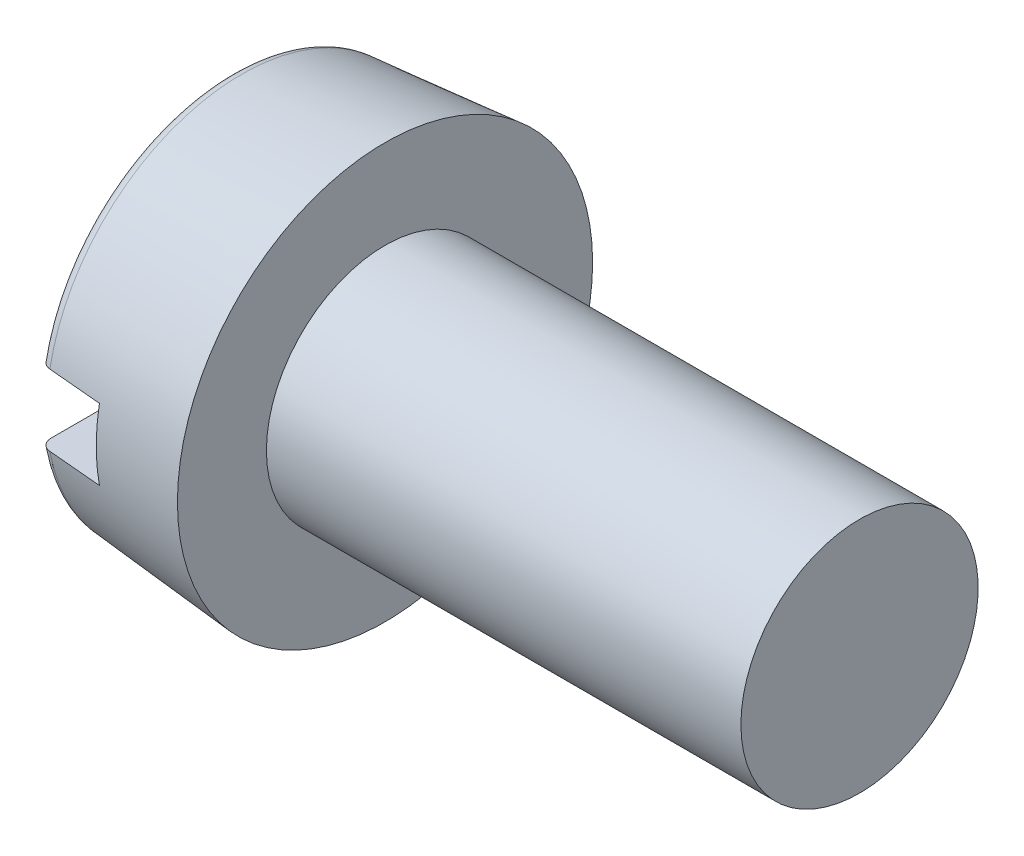
ISO-10303-21;
HEADER;
FILE_DESCRIPTION(('STEP AP214'),'2;1');
FILE_NAME('part.step','',(''),(''),'','','');
FILE_SCHEMA(('AUTOMOTIVE_DESIGN { 1 0 10303 214 1 1 1 1 }'));
ENDSEC;
DATA;
#1=APPLICATION_CONTEXT('core data for automotive mechanical design processes');
#2=APPLICATION_PROTOCOL_DEFINITION('international standard','automotive_design',2000,#1);
#3=PRODUCT_CONTEXT('',#1,'mechanical');
#4=PRODUCT('Part','Part','',(#3));
#5=PRODUCT_RELATED_PRODUCT_CATEGORY('part','',(#4));
#6=PRODUCT_DEFINITION_FORMATION('','',#4);
#7=PRODUCT_DEFINITION_CONTEXT('part definition',#1,'design');
#8=PRODUCT_DEFINITION('design','',#6,#7);
#9=PRODUCT_DEFINITION_SHAPE('','',#8);
#10=(LENGTH_UNIT() NAMED_UNIT(*) SI_UNIT(.MILLI.,.METRE.));
#11=(NAMED_UNIT(*) PLANE_ANGLE_UNIT() SI_UNIT($,.RADIAN.));
#12=(NAMED_UNIT(*) SI_UNIT($,.STERADIAN.) SOLID_ANGLE_UNIT());
#13=UNCERTAINTY_MEASURE_WITH_UNIT(LENGTH_MEASURE(1.E-05),#10,'distance_accuracy_value','');
#14=(GEOMETRIC_REPRESENTATION_CONTEXT(3) GLOBAL_UNCERTAINTY_ASSIGNED_CONTEXT((#13)) GLOBAL_UNIT_ASSIGNED_CONTEXT((#10,
#11,#12)) REPRESENTATION_CONTEXT('',''));
#15=CARTESIAN_POINT('',(0.,0.,0.));
#16=DIRECTION('',(0.,0.,1.));
#17=DIRECTION('',(1.,0.,0.));
#18=AXIS2_PLACEMENT_3D('',#15,#16,#17);
#19=CARTESIAN_POINT('',(1.1,0.6,-3.5));
#20=DIRECTION('',(-1.,0.,0.));
#21=DIRECTION('',(0.,0.,1.));
#22=AXIS2_PLACEMENT_3D('',#19,#20,#21);
#23=PLANE('',#22);
#24=DIRECTION('',(0.,0.,1.));
#25=VECTOR('',#24,1.);
#26=CARTESIAN_POINT('',(1.1,0.6,3.5));
#27=LINE('',#26,#25);
#28=CARTESIAN_POINT('',(1.10000000000466,0.6,3.31490439259874));
#29=VERTEX_POINT('',#28);
#30=CARTESIAN_POINT('',(1.10000000000405,0.6,-3.31490439259869));
#31=VERTEX_POINT('',#30);
#32=EDGE_CURVE('E78',#29,#31,#27,.F.);
#33=ORIENTED_EDGE('',*,*,#32,.T.);
#34=CARTESIAN_POINT('',(1.10000000000809,0.,0.));
#35=DIRECTION('',(1.,0.,0.));
#36=DIRECTION('',(0.,0.,-1.));
#37=AXIS2_PLACEMENT_3D('',#34,#35,#36);
#38=CIRCLE('',#37,3.36876700471737);
#39=CARTESIAN_POINT('',(1.10000000000468,-0.6,-3.31490439259874));
#40=VERTEX_POINT('',#39);
#41=EDGE_CURVE('E87',#31,#40,#38,.F.);
#42=ORIENTED_EDGE('',*,*,#41,.T.);
#43=DIRECTION('',(0.,0.,-1.));
#44=VECTOR('',#43,1.);
#45=CARTESIAN_POINT('',(1.1,-0.6,-3.5));
#46=LINE('',#45,#44);
#47=CARTESIAN_POINT('',(1.10000000000405,-0.6,3.31490439259869));
#48=VERTEX_POINT('',#47);
#49=EDGE_CURVE('E85',#40,#48,#46,.F.);
#50=ORIENTED_EDGE('',*,*,#49,.T.);
#51=CARTESIAN_POINT('',(1.10000000000809,0.,0.));
#52=DIRECTION('',(1.,0.,0.));
#53=DIRECTION('',(0.,0.,-1.));
#54=AXIS2_PLACEMENT_3D('',#51,#52,#53);
#55=CIRCLE('',#54,3.36876700471737);
#56=EDGE_CURVE('E20',#48,#29,#55,.F.);
#57=ORIENTED_EDGE('',*,*,#56,.T.);
#58=EDGE_LOOP('',(#33,#42,#50,#57));
#59=FACE_BOUND('',#58,.T.);
#60=ADVANCED_FACE('F17',(#59),#23,.T.);
#61=CARTESIAN_POINT('',(1.1,0.6,3.5));
#62=DIRECTION('',(0.,1.,0.));
#63=DIRECTION('',(0.,0.,1.));
#64=AXIS2_PLACEMENT_3D('',#61,#62,#63);
#65=PLANE('',#64);
#66=ORIENTED_EDGE('',*,*,#32,.F.);
#67=CARTESIAN_POINT('',(0.182568851454256,0.6,3.2333027364581));
#68=CARTESIAN_POINT('',(0.335473556850061,0.6,3.24690847681179));
#69=CARTESIAN_POINT('',(0.488378505260504,0.6,3.26051148500036));
#70=CARTESIAN_POINT('',(0.794188888109492,0.6,3.28771203704714));
#71=CARTESIAN_POINT('',(0.947094322548035,0.6,3.30130958090535));
#72=CARTESIAN_POINT('',(1.10000000000122,0.6,3.31490439259843));
#73=B_SPLINE_CURVE_WITH_KNOTS('',3,(#67,#68,#69,#70,#71,#72),.UNSPECIFIED.,.F.,.F.,(4,2,4),(0.,
0.460526530963861,0.921053061924176),.UNSPECIFIED.);
#74=CARTESIAN_POINT('',(0.182568851463089,0.6,3.23330273645694));
#75=VERTEX_POINT('',#74);
#76=EDGE_CURVE('E69',#75,#29,#73,.T.);
#77=ORIENTED_EDGE('',*,*,#76,.F.);
#78=CARTESIAN_POINT('',(0.,0.6,3.03043682761993));
#79=CARTESIAN_POINT('',(-8.92276711974184E-06,0.600000000000927,3.04205210805298));
#80=CARTESIAN_POINT('',(0.000973204864241729,0.600000000000543,3.05366618875901));
#81=CARTESIAN_POINT('',(0.00485838237463909,0.599999999999457,3.07656708233098));
#82=CARTESIAN_POINT('',(0.0077611800515547,0.599999999998755,3.08785393796157));
#83=CARTESIAN_POINT('',(0.0154293297762815,0.599999999999336,3.10978668687681));
#84=CARTESIAN_POINT('',(0.0201960317635939,0.60000000000062,3.12043210913728));
#85=CARTESIAN_POINT('',(0.0314639130665987,0.59999999999938,3.14075672068877));
#86=CARTESIAN_POINT('',(0.0379643576695792,0.599999999996857,3.15043631688841));
#87=CARTESIAN_POINT('',(0.0524560587306094,0.599999999997461,3.16845455019423));
#88=CARTESIAN_POINT('',(0.0604324501561302,0.600000000000534,3.17680513564901));
#89=CARTESIAN_POINT('',(0.077695534249092,0.599999999999466,3.19201902933438));
#90=CARTESIAN_POINT('',(0.0869820289644168,0.599999999995325,3.19888256185703));
#91=CARTESIAN_POINT('',(0.106435856679454,0.599999999995523,3.21080710889614));
#92=CARTESIAN_POINT('',(0.116586055155841,0.599999999999724,3.2158960924536));
#93=CARTESIAN_POINT('',(0.137592975718862,0.600000000000276,3.22425888492082));
#94=CARTESIAN_POINT('',(0.148448535761882,0.59999999999664,3.22753559876399));
#95=CARTESIAN_POINT('',(0.167114441065982,0.599999999995136,3.23146563373131));
#96=CARTESIAN_POINT('',(0.174822526263817,0.599999999995827,3.23261780195108));
#97=CARTESIAN_POINT('',(0.18256885145479,0.6,3.23330273645209));
#98=B_SPLINE_CURVE_WITH_KNOTS('',3,(#78,#79,#80,#81,#82,#83,#84,#85,#86,#87,#88,#89,#90,#91,#92,
#93,#94,#95,#96,#97),.UNSPECIFIED.,.F.,.F.,(4,2,2,2,2,2,2,2,2,4),(0.,0.0348029281865732,
0.0696012873266002,0.104424896125296,0.139233771014051,0.173709468497491,0.208179962389297,
0.24207959089462,0.275924722159497,0.299249852575362),.UNSPECIFIED.);
#99=CARTESIAN_POINT('',(0.,0.6,3.03043682761993));
#100=VERTEX_POINT('',#99);
#101=EDGE_CURVE('E79',#100,#75,#98,.T.);
#102=ORIENTED_EDGE('',*,*,#101,.F.);
#103=DIRECTION('',(0.,0.,1.));
#104=VECTOR('',#103,1.);
#105=CARTESIAN_POINT('',(0.,0.6,0.));
#106=LINE('',#105,#104);
#107=CARTESIAN_POINT('',(0.,0.6,-3.03043682761993));
#108=VERTEX_POINT('',#107);
#109=EDGE_CURVE('E110',#108,#100,#106,.T.);
#110=ORIENTED_EDGE('',*,*,#109,.F.);
#111=CARTESIAN_POINT('',(0.182568851454788,0.6,-3.23330273645209));
#112=CARTESIAN_POINT('',(0.171472681594623,0.600000000000002,-3.23232565957753));
#113=CARTESIAN_POINT('',(0.160466490440903,0.600000000000001,-3.23038681875744));
#114=CARTESIAN_POINT('',(0.138948426592135,0.599999999999999,-3.22469378570043));
#115=CARTESIAN_POINT('',(0.128435940886201,0.599999999999998,-3.22094191371361));
#116=CARTESIAN_POINT('',(0.108187049490752,0.600000000000002,-3.21172671697903));
#117=CARTESIAN_POINT('',(0.0984508547008828,0.600000000000008,-3.20626292911875));
#118=CARTESIAN_POINT('',(0.080024520000221,0.599999999999992,-3.19379308445501));
#119=CARTESIAN_POINT('',(0.0713343007624213,0.599999999999969,-3.1867871447228));
#120=CARTESIAN_POINT('',(0.0551599248927893,0.600000000000031,-3.17137098416005));
#121=CARTESIAN_POINT('',(0.0476868506805737,0.600000000000118,-3.1629491407325));
#122=CARTESIAN_POINT('',(0.0342322998309476,0.599999999999882,-3.14498762109246));
#123=CARTESIAN_POINT('',(0.0282510437499761,0.599999999999561,-3.13544777989675));
#124=CARTESIAN_POINT('',(0.0178400343955592,0.599999999999599,-3.11534500552784));
#125=CARTESIAN_POINT('',(0.0134390539697862,0.599999999999972,-3.10476717226775));
#126=CARTESIAN_POINT('',(0.00645122030947714,0.600000000000028,-3.08304101716856));
#127=CARTESIAN_POINT('',(0.00386248123053304,0.599999999999714,-3.07189330136284));
#128=CARTESIAN_POINT('',(0.000734376375379277,0.599999999999458,-3.05062255742231));
#129=CARTESIAN_POINT('',(-6.07384206097023E-06,0.599999999999478,-3.04052874119681));
#130=CARTESIAN_POINT('',(0.,0.6,-3.03043682761993));
#131=B_SPLINE_CURVE_WITH_KNOTS('',3,(#111,#112,#113,#114,#115,#116,#117,#118,#119,#120,#121,
#122,#123,#124,#125,#126,#127,#128,#129,#130),.UNSPECIFIED.,.F.,.F.,(4,2,2,2,2,2,2,2,2,4),(0.,
0.0333698869919508,0.0666971810854076,0.100033498772122,0.133367286630275,0.166989405711504,
0.200616492680494,0.234828037616769,0.269003928393339,0.299257989197879),.UNSPECIFIED.);
#132=CARTESIAN_POINT('',(0.182568851462821,0.6,-3.23330273645994));
#133=VERTEX_POINT('',#132);
#134=EDGE_CURVE('E158',#133,#108,#131,.T.);
#135=ORIENTED_EDGE('',*,*,#134,.F.);
#136=CARTESIAN_POINT('',(1.10000000000126,0.6,-3.31490439259843));
#137=CARTESIAN_POINT('',(0.947094322548068,0.6,-3.30130958090535));
#138=CARTESIAN_POINT('',(0.794188888109517,0.6,-3.28771203704714));
#139=CARTESIAN_POINT('',(0.488378505260516,0.6,-3.26051148500036));
#140=CARTESIAN_POINT('',(0.335473556850066,0.6,-3.24690847681179));
#141=CARTESIAN_POINT('',(0.182568851454254,0.6,-3.2333027364581));
#142=B_SPLINE_CURVE_WITH_KNOTS('',3,(#136,#137,#138,#139,#140,#141),.UNSPECIFIED.,.F.,.F.,(4,2,
4),(0.,0.460526530960336,0.921053061924218),.UNSPECIFIED.);
#143=EDGE_CURVE('E90',#31,#133,#142,.T.);
#144=ORIENTED_EDGE('',*,*,#143,.F.);
#145=EDGE_LOOP('',(#66,#77,#102,#110,#135,#144));
#146=FACE_BOUND('',#145,.T.);
#147=ADVANCED_FACE('F88',(#146),#65,.F.);
#148=CARTESIAN_POINT('',(1.1,-0.6,-3.5));
#149=DIRECTION('',(0.,-1.,0.));
#150=DIRECTION('',(0.,0.,-1.));
#151=AXIS2_PLACEMENT_3D('',#148,#149,#150);
#152=PLANE('',#151);
#153=CARTESIAN_POINT('',(0.,-0.6,-3.03043682761993));
#154=CARTESIAN_POINT('',(-8.92276711967487E-06,-0.600000000000927,-3.04205210805298));
#155=CARTESIAN_POINT('',(0.000973204864241762,-0.600000000000543,-3.05366618875901));
#156=CARTESIAN_POINT('',(0.00485838237463903,-0.599999999999457,-3.07656708233098));
#157=CARTESIAN_POINT('',(0.00776118005155457,-0.599999999998755,-3.08785393796157));
#158=CARTESIAN_POINT('',(0.0154293297762813,-0.599999999999336,-3.10978668687681));
#159=CARTESIAN_POINT('',(0.0201960317635939,-0.60000000000062,-3.12043210913728));
#160=CARTESIAN_POINT('',(0.0314639130665989,-0.59999999999938,-3.14075672068877));
#161=CARTESIAN_POINT('',(0.0379643576695795,-0.599999999996856,-3.15043631688841));
#162=CARTESIAN_POINT('',(0.0524560587306098,-0.599999999997461,-3.16845455019423));
#163=CARTESIAN_POINT('',(0.0604324501561305,-0.600000000000534,-3.17680513564901));
#164=CARTESIAN_POINT('',(0.0776955342490921,-0.599999999999466,-3.19201902933438));
#165=CARTESIAN_POINT('',(0.0869820289644169,-0.599999999995324,-3.19888256185703));
#166=CARTESIAN_POINT('',(0.106435856679454,-0.599999999995523,-3.21080710889614));
#167=CARTESIAN_POINT('',(0.116586055155841,-0.599999999999724,-3.2158960924536));
#168=CARTESIAN_POINT('',(0.137592975718862,-0.600000000000276,-3.22425888492082));
#169=CARTESIAN_POINT('',(0.148448535761883,-0.599999999996639,-3.22753559876399));
#170=CARTESIAN_POINT('',(0.167114441066279,-0.599999999995135,-3.23146563373137));
#171=CARTESIAN_POINT('',(0.174822526264417,-0.599999999995826,-3.23261780195117));
#172=CARTESIAN_POINT('',(0.182568851455695,-0.6,-3.23330273645218));
#173=B_SPLINE_CURVE_WITH_KNOTS('',3,(#153,#154,#155,#156,#157,#158,#159,#160,#161,#162,#163,
#164,#165,#166,#167,#168,#169,#170,#171,#172),.UNSPECIFIED.,.F.,.F.,(4,2,2,2,2,2,2,2,2,4),(0.,
0.0348029281865732,0.0696012873266001,0.104424896125296,0.139233771014051,0.173709468497491,
0.208179962389297,0.242079590894619,0.275924722159498,0.299249852576269),.UNSPECIFIED.);
#174=CARTESIAN_POINT('',(0.,-0.6,-3.03043682761993));
#175=VERTEX_POINT('',#174);
#176=CARTESIAN_POINT('',(0.182568851463542,-0.6,-3.23330273645698));
#177=VERTEX_POINT('',#176);
#178=EDGE_CURVE('E111',#175,#177,#173,.T.);
#179=ORIENTED_EDGE('',*,*,#178,.F.);
#180=DIRECTION('',(0.,0.,1.));
#181=VECTOR('',#180,1.);
#182=CARTESIAN_POINT('',(0.,-0.6,0.));
#183=LINE('',#182,#181);
#184=CARTESIAN_POINT('',(0.,-0.6,3.03043682761993));
#185=VERTEX_POINT('',#184);
#186=EDGE_CURVE('E181',#185,#175,#183,.F.);
#187=ORIENTED_EDGE('',*,*,#186,.F.);
#188=CARTESIAN_POINT('',(0.18256885145479,-0.6,3.23330273645209));
#189=CARTESIAN_POINT('',(0.171472681594624,-0.600000000000004,3.23232565957753));
#190=CARTESIAN_POINT('',(0.160466490440904,-0.600000000000002,3.23038681875744));
#191=CARTESIAN_POINT('',(0.138948426592136,-0.599999999999999,3.22469378570043));
#192=CARTESIAN_POINT('',(0.128435940886202,-0.599999999999997,3.22094191371361));
#193=CARTESIAN_POINT('',(0.108187049490754,-0.600000000000002,3.21172671697903));
#194=CARTESIAN_POINT('',(0.0984508547008837,-0.600000000000009,3.20626292911876));
#195=CARTESIAN_POINT('',(0.0800245200002219,-0.599999999999992,3.19379308445501));
#196=CARTESIAN_POINT('',(0.0713343007624226,-0.599999999999969,3.1867871447228));
#197=CARTESIAN_POINT('',(0.0551599248927912,-0.600000000000031,3.17137098416005));
#198=CARTESIAN_POINT('',(0.0476868506805758,-0.600000000000118,3.1629491407325));
#199=CARTESIAN_POINT('',(0.0342322998309492,-0.599999999999884,3.14498762109247));
#200=CARTESIAN_POINT('',(0.028251043749977,-0.599999999999562,3.13544777989675));
#201=CARTESIAN_POINT('',(0.0178400343955596,-0.5999999999996,3.11534500552784));
#202=CARTESIAN_POINT('',(0.0134390539697872,-0.599999999999972,3.10476717226775));
#203=CARTESIAN_POINT('',(0.0064512203094781,-0.600000000000029,3.08304101716857));
#204=CARTESIAN_POINT('',(0.00386248123053366,-0.599999999999715,3.07189330136284));
#205=CARTESIAN_POINT('',(0.000734376375379537,-0.599999999999459,3.05062255742231));
#206=CARTESIAN_POINT('',(-6.07384206089883E-06,-0.599999999999478,3.04052874119681));
#207=CARTESIAN_POINT('',(0.,-0.6,3.03043682761993));
#208=B_SPLINE_CURVE_WITH_KNOTS('',3,(#188,#189,#190,#191,#192,#193,#194,#195,#196,#197,#198,
#199,#200,#201,#202,#203,#204,#205,#206,#207),.UNSPECIFIED.,.F.,.F.,(4,2,2,2,2,2,2,2,2,4),(0.,
0.0333698869919515,0.0666971810854082,0.100033498772123,0.133367286630275,0.166989405711503,
0.200616492680491,0.234828037616767,0.269003928393341,0.299257989197881),.UNSPECIFIED.);
#209=CARTESIAN_POINT('',(0.182568851462822,-0.6,3.23330273645994));
#210=VERTEX_POINT('',#209);
#211=EDGE_CURVE('E35',#210,#185,#208,.T.);
#212=ORIENTED_EDGE('',*,*,#211,.F.);
#213=CARTESIAN_POINT('',(1.10000000000122,-0.6,3.31490439259843));
#214=CARTESIAN_POINT('',(0.947094322548035,-0.600000000000001,3.30130958090535));
#215=CARTESIAN_POINT('',(0.794188888109492,-0.600000000000001,3.28771203704714));
#216=CARTESIAN_POINT('',(0.488378505260504,-0.600000000000001,3.26051148500036));
#217=CARTESIAN_POINT('',(0.335473556850061,-0.600000000000001,3.24690847681179));
#218=CARTESIAN_POINT('',(0.182568851454256,-0.6,3.2333027364581));
#219=B_SPLINE_CURVE_WITH_KNOTS('',3,(#213,#214,#215,#216,#217,#218),.UNSPECIFIED.,.F.,.F.,(4,2,
4),(0.,0.460526530960315,0.921053061924176),.UNSPECIFIED.);
#220=EDGE_CURVE('E129',#48,#210,#219,.T.);
#221=ORIENTED_EDGE('',*,*,#220,.F.);
#222=ORIENTED_EDGE('',*,*,#49,.F.);
#223=CARTESIAN_POINT('',(0.182568851455161,-0.6,-3.23330273645818));
#224=CARTESIAN_POINT('',(0.335473556850822,-0.6,-3.24690847681186));
#225=CARTESIAN_POINT('',(0.488378505261121,-0.6,-3.26051148500042));
#226=CARTESIAN_POINT('',(0.79418888810982,-0.6,-3.28771203704717));
#227=CARTESIAN_POINT('',(0.94709432254822,-0.6,-3.30130958090537));
#228=CARTESIAN_POINT('',(1.10000000000126,-0.6,-3.31490439259843));
#229=B_SPLINE_CURVE_WITH_KNOTS('',3,(#223,#224,#225,#226,#227,#228),.UNSPECIFIED.,.F.,.F.,(4,2,
4),(0.,0.460526530963426,0.921053061923307),.UNSPECIFIED.);
#230=EDGE_CURVE('E102',#177,#40,#229,.T.);
#231=ORIENTED_EDGE('',*,*,#230,.F.);
#232=EDGE_LOOP('',(#179,#187,#212,#221,#222,#231));
#233=FACE_BOUND('',#232,.T.);
#234=ADVANCED_FACE('F113',(#233),#152,.F.);
#235=CARTESIAN_POINT('',(0.,0.,0.));
#236=DIRECTION('',(-1.,0.,0.));
#237=DIRECTION('',(0.,0.,1.));
#238=AXIS2_PLACEMENT_3D('',#235,#236,#237);
#239=PLANE('',#238);
#240=ORIENTED_EDGE('',*,*,#109,.T.);
#241=CARTESIAN_POINT('',(0.,0.,0.));
#242=DIRECTION('',(1.,0.,0.));
#243=DIRECTION('',(0.,0.194221066118774,-0.980957785776578));
#244=AXIS2_PLACEMENT_3D('',#241,#242,#243);
#245=CIRCLE('',#244,3.08926324002912);
#246=EDGE_CURVE('E188',#108,#100,#245,.T.);
#247=ORIENTED_EDGE('',*,*,#246,.F.);
#248=EDGE_LOOP('',(#240,#247));
#249=FACE_BOUND('',#248,.T.);
#250=ADVANCED_FACE('F209',(#249),#239,.T.);
#251=CARTESIAN_POINT('',(0.,0.,0.));
#252=DIRECTION('',(-1.,0.,0.));
#253=DIRECTION('',(0.,0.,1.));
#254=AXIS2_PLACEMENT_3D('',#251,#252,#253);
#255=PLANE('',#254);
#256=ORIENTED_EDGE('',*,*,#186,.T.);
#257=CARTESIAN_POINT('',(0.,0.,0.));
#258=DIRECTION('',(1.,0.,0.));
#259=DIRECTION('',(0.,-0.194221066118772,0.980957785776578));
#260=AXIS2_PLACEMENT_3D('',#257,#258,#259);
#261=CIRCLE('',#260,3.08926324002912);
#262=EDGE_CURVE('E173',#185,#175,#261,.T.);
#263=ORIENTED_EDGE('',*,*,#262,.F.);
#264=EDGE_LOOP('',(#256,#263));
#265=FACE_BOUND('',#264,.T.);
#266=ADVANCED_FACE('F164',(#265),#255,.T.);
#267=CARTESIAN_POINT('',(0.2,0.,0.));
#268=DIRECTION('',(-1.,0.,0.));
#269=DIRECTION('',(0.,0.,1.));
#270=AXIS2_PLACEMENT_3D('',#267,#268,#269);
#271=TOROIDAL_SURFACE('',#270,3.08926324002912,0.2);
#272=ORIENTED_EDGE('',*,*,#101,.T.);
#273=CARTESIAN_POINT('',(0.182568851471388,0.,0.));
#274=DIRECTION('',(1.,0.,0.));
#275=DIRECTION('',(0.,0.,-1.));
#276=AXIS2_PLACEMENT_3D('',#273,#274,#275);
#277=CIRCLE('',#276,3.28850217965737);
#278=EDGE_CURVE('E75',#133,#75,#277,.T.);
#279=ORIENTED_EDGE('',*,*,#278,.F.);
#280=ORIENTED_EDGE('',*,*,#134,.T.);
#281=ORIENTED_EDGE('',*,*,#246,.T.);
#282=EDGE_LOOP('',(#272,#279,#280,#281));
#283=FACE_BOUND('',#282,.T.);
#284=ADVANCED_FACE('F159',(#283),#271,.T.);
#285=CARTESIAN_POINT('',(0.2,0.,0.));
#286=DIRECTION('',(-1.,0.,0.));
#287=DIRECTION('',(0.,0.,1.));
#288=AXIS2_PLACEMENT_3D('',#285,#286,#287);
#289=TOROIDAL_SURFACE('',#288,3.08926324002912,0.2);
#290=ORIENTED_EDGE('',*,*,#211,.T.);
#291=ORIENTED_EDGE('',*,*,#262,.T.);
#292=ORIENTED_EDGE('',*,*,#178,.T.);
#293=CARTESIAN_POINT('',(0.182568851471388,0.,0.));
#294=DIRECTION('',(1.,0.,0.));
#295=DIRECTION('',(0.,0.,-1.));
#296=AXIS2_PLACEMENT_3D('',#293,#294,#295);
#297=CIRCLE('',#296,3.28850217965737);
#298=EDGE_CURVE('E101',#210,#177,#297,.T.);
#299=ORIENTED_EDGE('',*,*,#298,.F.);
#300=EDGE_LOOP('',(#290,#291,#292,#299));
#301=FACE_BOUND('',#300,.T.);
#302=ADVANCED_FACE('F121',(#301),#289,.T.);
#303=CARTESIAN_POINT('',(2.59999999997263,0.,0.));
#304=DIRECTION('',(1.,0.,0.));
#305=DIRECTION('',(0.,0.,-1.));
#306=AXIS2_PLACEMENT_3D('',#303,#304,#305);
#307=CONICAL_SURFACE('',#306,3.5000000000025,0.0872664625992853);
#308=ORIENTED_EDGE('',*,*,#56,.F.);
#309=ORIENTED_EDGE('',*,*,#220,.T.);
#310=ORIENTED_EDGE('',*,*,#298,.T.);
#311=ORIENTED_EDGE('',*,*,#230,.T.);
#312=ORIENTED_EDGE('',*,*,#41,.F.);
#313=ORIENTED_EDGE('',*,*,#143,.T.);
#314=ORIENTED_EDGE('',*,*,#278,.T.);
#315=ORIENTED_EDGE('',*,*,#76,.T.);
#316=EDGE_LOOP('',(#308,#309,#310,#311,#312,#313,#314,#315));
#317=FACE_BOUND('',#316,.T.);
#318=CARTESIAN_POINT('',(2.59999999997263,0.,0.));
#319=DIRECTION('',(1.,0.,0.));
#320=DIRECTION('',(0.,0.,-1.));
#321=AXIS2_PLACEMENT_3D('',#318,#319,#320);
#322=CIRCLE('',#321,3.5000000000025);
#323=CARTESIAN_POINT('',(2.59999999997263,0.,-3.5000000000025));
#324=VERTEX_POINT('',#323);
#325=EDGE_CURVE('E98',#324,#324,#322,.F.);
#326=ORIENTED_EDGE('',*,*,#325,.T.);
#327=EDGE_LOOP('',(#326));
#328=FACE_BOUND('',#327,.T.);
#329=ADVANCED_FACE('F71',(#317,#328),#307,.T.);
#330=CARTESIAN_POINT('',(10.6,2.,0.));
#331=DIRECTION('',(1.,0.,0.));
#332=DIRECTION('',(0.,0.,-1.));
#333=AXIS2_PLACEMENT_3D('',#330,#331,#332);
#334=PLANE('',#333);
#335=CARTESIAN_POINT('',(10.6,0.,0.));
#336=DIRECTION('',(-1.,0.,0.));
#337=DIRECTION('',(0.,0.,1.));
#338=AXIS2_PLACEMENT_3D('',#335,#336,#337);
#339=CIRCLE('',#338,2.);
#340=CARTESIAN_POINT('',(10.6,0.,2.));
#341=VERTEX_POINT('',#340);
#342=EDGE_CURVE('E26',#341,#341,#339,.T.);
#343=ORIENTED_EDGE('',*,*,#342,.F.);
#344=EDGE_LOOP('',(#343));
#345=FACE_BOUND('',#344,.T.);
#346=ADVANCED_FACE('F120',(#345),#334,.T.);
#347=CARTESIAN_POINT('',(2.6,2.,0.));
#348=DIRECTION('',(-1.,0.,0.));
#349=DIRECTION('',(0.,0.,1.));
#350=AXIS2_PLACEMENT_3D('',#347,#348,#349);
#351=PLANE('',#350);
#352=CARTESIAN_POINT('',(2.6,0.,0.));
#353=DIRECTION('',(-1.,0.,0.));
#354=DIRECTION('',(0.,0.,1.));
#355=AXIS2_PLACEMENT_3D('',#352,#353,#354);
#356=CIRCLE('',#355,2.);
#357=CARTESIAN_POINT('',(2.6,0.,2.));
#358=VERTEX_POINT('',#357);
#359=EDGE_CURVE('E11',#358,#358,#356,.F.);
#360=ORIENTED_EDGE('',*,*,#359,.F.);
#361=EDGE_LOOP('',(#360));
#362=FACE_BOUND('',#361,.T.);
#363=ORIENTED_EDGE('',*,*,#325,.F.);
#364=EDGE_LOOP('',(#363));
#365=FACE_BOUND('',#364,.T.);
#366=ADVANCED_FACE('F226',(#362,#365),#351,.F.);
#367=CARTESIAN_POINT('',(-25.4,0.,0.));
#368=DIRECTION('',(-1.,0.,0.));
#369=DIRECTION('',(0.,0.,1.));
#370=AXIS2_PLACEMENT_3D('',#367,#368,#369);
#371=CYLINDRICAL_SURFACE('',#370,2.);
#372=ORIENTED_EDGE('',*,*,#359,.T.);
#373=EDGE_LOOP('',(#372));
#374=FACE_BOUND('',#373,.T.);
#375=ORIENTED_EDGE('',*,*,#342,.T.);
#376=EDGE_LOOP('',(#375));
#377=FACE_BOUND('',#376,.T.);
#378=ADVANCED_FACE('F224',(#374,#377),#371,.T.);
#379=CLOSED_SHELL('',(#60,#147,#234,#250,#266,#284,#302,#329,#346,#366,#378));
#380=MANIFOLD_SOLID_BREP('B1',#379);
#381=ADVANCED_BREP_SHAPE_REPRESENTATION('',(#18,#380),#14);
#382=SHAPE_DEFINITION_REPRESENTATION(#9,#381);
ENDSEC;
END-ISO-10303-21;
